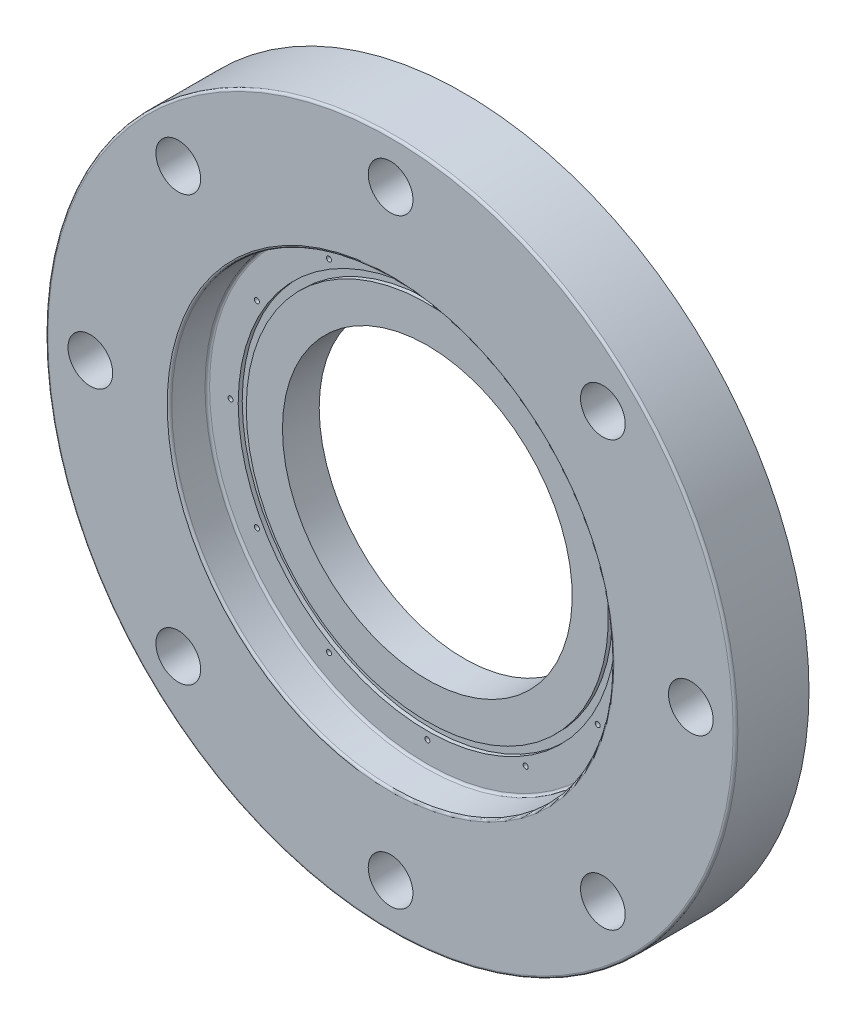
ISO-10303-21;
HEADER;
FILE_DESCRIPTION(('STEP AP214'),'2;1');
FILE_NAME('part.step','',(''),(''),'','','');
FILE_SCHEMA(('AUTOMOTIVE_DESIGN { 1 0 10303 214 1 1 1 1 }'));
ENDSEC;
DATA;
#1=APPLICATION_CONTEXT('core data for automotive mechanical design processes');
#2=APPLICATION_PROTOCOL_DEFINITION('international standard','automotive_design',2000,#1);
#3=PRODUCT_CONTEXT('',#1,'mechanical');
#4=PRODUCT('Part','Part','',(#3));
#5=PRODUCT_RELATED_PRODUCT_CATEGORY('part','',(#4));
#6=PRODUCT_DEFINITION_FORMATION('','',#4);
#7=PRODUCT_DEFINITION_CONTEXT('part definition',#1,'design');
#8=PRODUCT_DEFINITION('design','',#6,#7);
#9=PRODUCT_DEFINITION_SHAPE('','',#8);
#10=(LENGTH_UNIT() NAMED_UNIT(*) SI_UNIT(.MILLI.,.METRE.));
#11=(NAMED_UNIT(*) PLANE_ANGLE_UNIT() SI_UNIT($,.RADIAN.));
#12=(NAMED_UNIT(*) SI_UNIT($,.STERADIAN.) SOLID_ANGLE_UNIT());
#13=UNCERTAINTY_MEASURE_WITH_UNIT(LENGTH_MEASURE(1.E-05),#10,'distance_accuracy_value','');
#14=(GEOMETRIC_REPRESENTATION_CONTEXT(3) GLOBAL_UNCERTAINTY_ASSIGNED_CONTEXT((#13)) GLOBAL_UNIT_ASSIGNED_CONTEXT((#10,
#11,#12)) REPRESENTATION_CONTEXT('',''));
#15=CARTESIAN_POINT('',(0.,0.,0.));
#16=DIRECTION('',(0.,0.,1.));
#17=DIRECTION('',(1.,0.,0.));
#18=AXIS2_PLACEMENT_3D('',#15,#16,#17);
#19=CARTESIAN_POINT('',(0.,109.347,18.25625));
#20=DIRECTION('',(0.,0.,-1.));
#21=DIRECTION('',(0.,1.,0.));
#22=AXIS2_PLACEMENT_3D('',#19,#20,#21);
#23=PLANE('',#22);
#24=CARTESIAN_POINT('',(0.,0.,18.25625));
#25=DIRECTION('',(0.,0.,-1.));
#26=DIRECTION('',(0.,1.,0.));
#27=AXIS2_PLACEMENT_3D('',#24,#25,#26);
#28=CIRCLE('',#27,72.);
#29=CARTESIAN_POINT('',(0.,72.,18.25625));
#30=VERTEX_POINT('',#29);
#31=EDGE_CURVE('E42',#30,#30,#28,.T.);
#32=ORIENTED_EDGE('',*,*,#31,.T.);
#33=EDGE_LOOP('',(#32));
#34=FACE_BOUND('',#33,.T.);
#35=CARTESIAN_POINT('',(0.,0.,18.25625));
#36=DIRECTION('',(0.,0.,-1.));
#37=DIRECTION('',(-1.,0.,0.));
#38=AXIS2_PLACEMENT_3D('',#35,#36,#37);
#39=CIRCLE('',#38,90.);
#40=CARTESIAN_POINT('',(-90.,0.,18.25625));
#41=VERTEX_POINT('',#40);
#42=EDGE_CURVE('E834',#41,#41,#39,.T.);
#43=ORIENTED_EDGE('',*,*,#42,.F.);
#44=EDGE_LOOP('',(#43));
#45=FACE_BOUND('',#44,.T.);
#46=ADVANCED_FACE('F38',(#34,#45),#23,.F.);
#47=CARTESIAN_POINT('',(0.,0.,36.5125));
#48=DIRECTION('',(0.,0.,-1.));
#49=DIRECTION('',(-1.,0.,0.));
#50=AXIS2_PLACEMENT_3D('',#47,#48,#49);
#51=CYLINDRICAL_SURFACE('',#50,171.45);
#52=CARTESIAN_POINT('',(0.,0.,35.3579545454545));
#53=DIRECTION('',(0.,0.,1.));
#54=DIRECTION('',(1.,0.,0.));
#55=AXIS2_PLACEMENT_3D('',#52,#53,#54);
#56=CIRCLE('',#55,171.45);
#57=CARTESIAN_POINT('',(171.45,0.,35.3579545454545));
#58=VERTEX_POINT('',#57);
#59=EDGE_CURVE('E11',#58,#58,#56,.F.);
#60=ORIENTED_EDGE('',*,*,#59,.T.);
#61=EDGE_LOOP('',(#60));
#62=FACE_BOUND('',#61,.T.);
#63=CARTESIAN_POINT('',(0.,0.,0.));
#64=DIRECTION('',(0.,0.,1.));
#65=DIRECTION('',(1.,0.,0.));
#66=AXIS2_PLACEMENT_3D('',#63,#64,#65);
#67=CIRCLE('',#66,171.45);
#68=CARTESIAN_POINT('',(171.45,0.,0.));
#69=VERTEX_POINT('',#68);
#70=EDGE_CURVE('E216',#69,#69,#67,.T.);
#71=ORIENTED_EDGE('',*,*,#70,.T.);
#72=EDGE_LOOP('',(#71));
#73=FACE_BOUND('',#72,.T.);
#74=ADVANCED_FACE('F254',(#62,#73),#51,.T.);
#75=CARTESIAN_POINT('',(0.,0.,36.5125));
#76=DIRECTION('',(0.,0.,1.));
#77=DIRECTION('',(1.,0.,0.));
#78=AXIS2_PLACEMENT_3D('',#75,#76,#77);
#79=PLANE('',#78);
#80=CARTESIAN_POINT('',(0.,0.,36.5125));
#81=DIRECTION('',(0.,0.,1.));
#82=DIRECTION('',(1.,0.,0.));
#83=AXIS2_PLACEMENT_3D('',#80,#81,#82);
#84=CIRCLE('',#83,111.037468728978);
#85=CARTESIAN_POINT('',(111.037468728978,0.,36.5125));
#86=VERTEX_POINT('',#85);
#87=EDGE_CURVE('E47',#86,#86,#84,.F.);
#88=ORIENTED_EDGE('',*,*,#87,.T.);
#89=EDGE_LOOP('',(#88));
#90=FACE_BOUND('',#89,.T.);
#91=CARTESIAN_POINT('',(0.,0.,36.5125));
#92=DIRECTION('',(0.,0.,1.));
#93=DIRECTION('',(1.,0.,0.));
#94=AXIS2_PLACEMENT_3D('',#91,#92,#93);
#95=CIRCLE('',#94,170.295454545455);
#96=CARTESIAN_POINT('',(170.295454545455,0.,36.5125));
#97=VERTEX_POINT('',#96);
#98=EDGE_CURVE('E230',#97,#97,#95,.T.);
#99=ORIENTED_EDGE('',*,*,#98,.T.);
#100=EDGE_LOOP('',(#99));
#101=FACE_BOUND('',#100,.T.);
#102=CARTESIAN_POINT('',(105.518009422561,105.518009422564,36.5125));
#103=DIRECTION('',(0.,0.,1.));
#104=DIRECTION('',(0.707106781186556,-0.707106781186539,0.));
#105=AXIS2_PLACEMENT_3D('',#102,#103,#104);
#106=CIRCLE('',#105,11.1125);
#107=CARTESIAN_POINT('',(113.375733528497,97.6602853166284,36.5125));
#108=VERTEX_POINT('',#107);
#109=EDGE_CURVE('E174',#108,#108,#106,.T.);
#110=ORIENTED_EDGE('',*,*,#109,.F.);
#111=EDGE_LOOP('',(#110));
#112=FACE_BOUND('',#111,.T.);
#113=CARTESIAN_POINT('',(149.225,1.5630489083666E-12,36.5125));
#114=DIRECTION('',(0.,0.,1.));
#115=DIRECTION('',(0.,-1.,0.));
#116=AXIS2_PLACEMENT_3D('',#113,#114,#115);
#117=CIRCLE('',#116,11.1125);
#118=CARTESIAN_POINT('',(149.225,-11.1124999999984,36.5125));
#119=VERTEX_POINT('',#118);
#120=EDGE_CURVE('E173',#119,#119,#117,.T.);
#121=ORIENTED_EDGE('',*,*,#120,.F.);
#122=EDGE_LOOP('',(#121));
#123=FACE_BOUND('',#122,.T.);
#124=CARTESIAN_POINT('',(105.518009422563,-105.518009422562,36.5125));
#125=DIRECTION('',(0.,0.,1.));
#126=DIRECTION('',(-0.707106781186541,-0.707106781186554,0.));
#127=AXIS2_PLACEMENT_3D('',#124,#125,#126);
#128=CIRCLE('',#127,11.1125);
#129=CARTESIAN_POINT('',(97.660285316628,-113.375733528497,36.5125));
#130=VERTEX_POINT('',#129);
#131=EDGE_CURVE('E180',#130,#130,#128,.T.);
#132=ORIENTED_EDGE('',*,*,#131,.F.);
#133=EDGE_LOOP('',(#132));
#134=FACE_BOUND('',#133,.T.);
#135=CARTESIAN_POINT('',(1.04203260557773E-12,-149.225,36.5125));
#136=DIRECTION('',(0.,0.,1.));
#137=DIRECTION('',(-1.,0.,0.));
#138=AXIS2_PLACEMENT_3D('',#135,#136,#137);
#139=CIRCLE('',#138,11.1125);
#140=CARTESIAN_POINT('',(-11.112499999999,-149.225,36.5125));
#141=VERTEX_POINT('',#140);
#142=EDGE_CURVE('E186',#141,#141,#139,.T.);
#143=ORIENTED_EDGE('',*,*,#142,.F.);
#144=EDGE_LOOP('',(#143));
#145=FACE_BOUND('',#144,.T.);
#146=CARTESIAN_POINT('',(-105.518009422562,-105.518009422563,36.5125));
#147=DIRECTION('',(0.,0.,1.));
#148=DIRECTION('',(-0.707106781186551,0.707106781186544,0.));
#149=AXIS2_PLACEMENT_3D('',#146,#147,#148);
#150=CIRCLE('',#149,11.1125);
#151=CARTESIAN_POINT('',(-113.375733528498,-97.6602853166276,36.5125));
#152=VERTEX_POINT('',#151);
#153=EDGE_CURVE('E192',#152,#152,#150,.T.);
#154=ORIENTED_EDGE('',*,*,#153,.F.);
#155=EDGE_LOOP('',(#154));
#156=FACE_BOUND('',#155,.T.);
#157=CARTESIAN_POINT('',(-149.225,-5.21016302788867E-13,36.5125));
#158=DIRECTION('',(0.,0.,1.));
#159=DIRECTION('',(0.,1.,0.));
#160=AXIS2_PLACEMENT_3D('',#157,#158,#159);
#161=CIRCLE('',#160,11.1125);
#162=CARTESIAN_POINT('',(-149.225,11.1124999999995,36.5125));
#163=VERTEX_POINT('',#162);
#164=EDGE_CURVE('E198',#163,#163,#161,.T.);
#165=ORIENTED_EDGE('',*,*,#164,.F.);
#166=EDGE_LOOP('',(#165));
#167=FACE_BOUND('',#166,.T.);
#168=CARTESIAN_POINT('',(-105.518009422563,105.518009422562,36.5125));
#169=DIRECTION('',(0.,0.,1.));
#170=DIRECTION('',(0.707106781186546,0.707106781186549,0.));
#171=AXIS2_PLACEMENT_3D('',#168,#169,#170);
#172=CIRCLE('',#171,11.1125);
#173=CARTESIAN_POINT('',(-97.6602853166273,113.375733528498,36.5125));
#174=VERTEX_POINT('',#173);
#175=EDGE_CURVE('E204',#174,#174,#172,.T.);
#176=ORIENTED_EDGE('',*,*,#175,.F.);
#177=EDGE_LOOP('',(#176));
#178=FACE_BOUND('',#177,.T.);
#179=CARTESIAN_POINT('',(0.,149.225,36.5125));
#180=DIRECTION('',(0.,0.,1.));
#181=DIRECTION('',(1.,0.,0.));
#182=AXIS2_PLACEMENT_3D('',#179,#180,#181);
#183=CIRCLE('',#182,11.1125);
#184=CARTESIAN_POINT('',(11.1125,149.225,36.5125));
#185=VERTEX_POINT('',#184);
#186=EDGE_CURVE('E210',#185,#185,#183,.T.);
#187=ORIENTED_EDGE('',*,*,#186,.F.);
#188=EDGE_LOOP('',(#187));
#189=FACE_BOUND('',#188,.T.);
#190=ADVANCED_FACE('F236',(#90,#101,#112,#123,#134,#145,#156,#167,#178,#189),#79,.T.);
#191=CARTESIAN_POINT('',(0.,0.,0.));
#192=DIRECTION('',(0.,0.,1.));
#193=DIRECTION('',(1.,0.,0.));
#194=AXIS2_PLACEMENT_3D('',#191,#192,#193);
#195=PLANE('',#194);
#196=CARTESIAN_POINT('',(0.,0.,0.));
#197=DIRECTION('',(0.,0.,-1.));
#198=DIRECTION('',(-1.,0.,0.));
#199=AXIS2_PLACEMENT_3D('',#196,#197,#198);
#200=CIRCLE('',#199,72.);
#201=CARTESIAN_POINT('',(-72.,0.,0.));
#202=VERTEX_POINT('',#201);
#203=EDGE_CURVE('E167',#202,#202,#200,.T.);
#204=ORIENTED_EDGE('',*,*,#203,.F.);
#205=EDGE_LOOP('',(#204));
#206=FACE_BOUND('',#205,.T.);
#207=CARTESIAN_POINT('',(105.518009422561,105.518009422564,0.));
#208=DIRECTION('',(0.,0.,1.));
#209=DIRECTION('',(0.707106781186556,-0.707106781186539,0.));
#210=AXIS2_PLACEMENT_3D('',#207,#208,#209);
#211=CIRCLE('',#210,11.1125);
#212=CARTESIAN_POINT('',(113.375733528497,97.6602853166284,0.));
#213=VERTEX_POINT('',#212);
#214=EDGE_CURVE('E170',#213,#213,#211,.T.);
#215=ORIENTED_EDGE('',*,*,#214,.T.);
#216=EDGE_LOOP('',(#215));
#217=FACE_BOUND('',#216,.T.);
#218=CARTESIAN_POINT('',(149.225,1.5630489083666E-12,0.));
#219=DIRECTION('',(0.,0.,1.));
#220=DIRECTION('',(0.,-1.,0.));
#221=AXIS2_PLACEMENT_3D('',#218,#219,#220);
#222=CIRCLE('',#221,11.1125);
#223=CARTESIAN_POINT('',(149.225,-11.1124999999984,0.));
#224=VERTEX_POINT('',#223);
#225=EDGE_CURVE('E177',#224,#224,#222,.T.);
#226=ORIENTED_EDGE('',*,*,#225,.T.);
#227=EDGE_LOOP('',(#226));
#228=FACE_BOUND('',#227,.T.);
#229=CARTESIAN_POINT('',(105.518009422563,-105.518009422562,0.));
#230=DIRECTION('',(0.,0.,1.));
#231=DIRECTION('',(-0.707106781186541,-0.707106781186554,0.));
#232=AXIS2_PLACEMENT_3D('',#229,#230,#231);
#233=CIRCLE('',#232,11.1125);
#234=CARTESIAN_POINT('',(97.660285316628,-113.375733528497,0.));
#235=VERTEX_POINT('',#234);
#236=EDGE_CURVE('E183',#235,#235,#233,.T.);
#237=ORIENTED_EDGE('',*,*,#236,.T.);
#238=EDGE_LOOP('',(#237));
#239=FACE_BOUND('',#238,.T.);
#240=CARTESIAN_POINT('',(1.04203260557773E-12,-149.225,0.));
#241=DIRECTION('',(0.,0.,1.));
#242=DIRECTION('',(-1.,0.,0.));
#243=AXIS2_PLACEMENT_3D('',#240,#241,#242);
#244=CIRCLE('',#243,11.1125);
#245=CARTESIAN_POINT('',(-11.112499999999,-149.225,0.));
#246=VERTEX_POINT('',#245);
#247=EDGE_CURVE('E189',#246,#246,#244,.T.);
#248=ORIENTED_EDGE('',*,*,#247,.T.);
#249=EDGE_LOOP('',(#248));
#250=FACE_BOUND('',#249,.T.);
#251=CARTESIAN_POINT('',(-105.518009422562,-105.518009422563,0.));
#252=DIRECTION('',(0.,0.,1.));
#253=DIRECTION('',(-0.707106781186551,0.707106781186544,0.));
#254=AXIS2_PLACEMENT_3D('',#251,#252,#253);
#255=CIRCLE('',#254,11.1125);
#256=CARTESIAN_POINT('',(-113.375733528498,-97.6602853166276,0.));
#257=VERTEX_POINT('',#256);
#258=EDGE_CURVE('E195',#257,#257,#255,.T.);
#259=ORIENTED_EDGE('',*,*,#258,.T.);
#260=EDGE_LOOP('',(#259));
#261=FACE_BOUND('',#260,.T.);
#262=CARTESIAN_POINT('',(-149.225,-5.21016302788867E-13,0.));
#263=DIRECTION('',(0.,0.,1.));
#264=DIRECTION('',(0.,1.,0.));
#265=AXIS2_PLACEMENT_3D('',#262,#263,#264);
#266=CIRCLE('',#265,11.1125);
#267=CARTESIAN_POINT('',(-149.225,11.1124999999995,0.));
#268=VERTEX_POINT('',#267);
#269=EDGE_CURVE('E201',#268,#268,#266,.T.);
#270=ORIENTED_EDGE('',*,*,#269,.T.);
#271=EDGE_LOOP('',(#270));
#272=FACE_BOUND('',#271,.T.);
#273=CARTESIAN_POINT('',(-105.518009422563,105.518009422562,0.));
#274=DIRECTION('',(0.,0.,1.));
#275=DIRECTION('',(0.707106781186546,0.707106781186549,0.));
#276=AXIS2_PLACEMENT_3D('',#273,#274,#275);
#277=CIRCLE('',#276,11.1125);
#278=CARTESIAN_POINT('',(-97.6602853166273,113.375733528498,0.));
#279=VERTEX_POINT('',#278);
#280=EDGE_CURVE('E207',#279,#279,#277,.T.);
#281=ORIENTED_EDGE('',*,*,#280,.T.);
#282=EDGE_LOOP('',(#281));
#283=FACE_BOUND('',#282,.T.);
#284=CARTESIAN_POINT('',(0.,149.225,0.));
#285=DIRECTION('',(0.,0.,1.));
#286=DIRECTION('',(1.,0.,0.));
#287=AXIS2_PLACEMENT_3D('',#284,#285,#286);
#288=CIRCLE('',#287,11.1125);
#289=CARTESIAN_POINT('',(11.1125,149.225,0.));
#290=VERTEX_POINT('',#289);
#291=EDGE_CURVE('E213',#290,#290,#288,.T.);
#292=ORIENTED_EDGE('',*,*,#291,.T.);
#293=EDGE_LOOP('',(#292));
#294=FACE_BOUND('',#293,.T.);
#295=ORIENTED_EDGE('',*,*,#70,.F.);
#296=EDGE_LOOP('',(#295));
#297=FACE_BOUND('',#296,.T.);
#298=ADVANCED_FACE('F334',(#206,#217,#228,#239,#250,#261,#272,#283,#294,#297),#195,.F.);
#299=CARTESIAN_POINT('',(0.,149.225,0.));
#300=DIRECTION('',(0.,0.,1.));
#301=DIRECTION('',(1.,0.,0.));
#302=AXIS2_PLACEMENT_3D('',#299,#300,#301);
#303=CYLINDRICAL_SURFACE('',#302,11.1125);
#304=ORIENTED_EDGE('',*,*,#291,.F.);
#305=EDGE_LOOP('',(#304));
#306=FACE_BOUND('',#305,.T.);
#307=ORIENTED_EDGE('',*,*,#186,.T.);
#308=EDGE_LOOP('',(#307));
#309=FACE_BOUND('',#308,.T.);
#310=ADVANCED_FACE('F337',(#306,#309),#303,.F.);
#311=CARTESIAN_POINT('',(-105.518009422563,105.518009422562,0.));
#312=DIRECTION('',(0.,0.,1.));
#313=DIRECTION('',(1.,0.,0.));
#314=AXIS2_PLACEMENT_3D('',#311,#312,#313);
#315=CYLINDRICAL_SURFACE('',#314,11.1125);
#316=ORIENTED_EDGE('',*,*,#280,.F.);
#317=EDGE_LOOP('',(#316));
#318=FACE_BOUND('',#317,.T.);
#319=ORIENTED_EDGE('',*,*,#175,.T.);
#320=EDGE_LOOP('',(#319));
#321=FACE_BOUND('',#320,.T.);
#322=ADVANCED_FACE('F360',(#318,#321),#315,.F.);
#323=CARTESIAN_POINT('',(-149.225,-5.21016302788867E-13,0.));
#324=DIRECTION('',(0.,0.,1.));
#325=DIRECTION('',(1.,0.,0.));
#326=AXIS2_PLACEMENT_3D('',#323,#324,#325);
#327=CYLINDRICAL_SURFACE('',#326,11.1125);
#328=ORIENTED_EDGE('',*,*,#269,.F.);
#329=EDGE_LOOP('',(#328));
#330=FACE_BOUND('',#329,.T.);
#331=ORIENTED_EDGE('',*,*,#164,.T.);
#332=EDGE_LOOP('',(#331));
#333=FACE_BOUND('',#332,.T.);
#334=ADVANCED_FACE('F371',(#330,#333),#327,.F.);
#335=CARTESIAN_POINT('',(-105.518009422562,-105.518009422563,0.));
#336=DIRECTION('',(0.,0.,1.));
#337=DIRECTION('',(1.,0.,0.));
#338=AXIS2_PLACEMENT_3D('',#335,#336,#337);
#339=CYLINDRICAL_SURFACE('',#338,11.1125);
#340=ORIENTED_EDGE('',*,*,#258,.F.);
#341=EDGE_LOOP('',(#340));
#342=FACE_BOUND('',#341,.T.);
#343=ORIENTED_EDGE('',*,*,#153,.T.);
#344=EDGE_LOOP('',(#343));
#345=FACE_BOUND('',#344,.T.);
#346=ADVANCED_FACE('F375',(#342,#345),#339,.F.);
#347=CARTESIAN_POINT('',(1.04203260557773E-12,-149.225,0.));
#348=DIRECTION('',(0.,0.,1.));
#349=DIRECTION('',(1.,0.,0.));
#350=AXIS2_PLACEMENT_3D('',#347,#348,#349);
#351=CYLINDRICAL_SURFACE('',#350,11.1125);
#352=ORIENTED_EDGE('',*,*,#247,.F.);
#353=EDGE_LOOP('',(#352));
#354=FACE_BOUND('',#353,.T.);
#355=ORIENTED_EDGE('',*,*,#142,.T.);
#356=EDGE_LOOP('',(#355));
#357=FACE_BOUND('',#356,.T.);
#358=ADVANCED_FACE('F379',(#354,#357),#351,.F.);
#359=CARTESIAN_POINT('',(105.518009422563,-105.518009422562,0.));
#360=DIRECTION('',(0.,0.,1.));
#361=DIRECTION('',(1.,0.,0.));
#362=AXIS2_PLACEMENT_3D('',#359,#360,#361);
#363=CYLINDRICAL_SURFACE('',#362,11.1125);
#364=ORIENTED_EDGE('',*,*,#236,.F.);
#365=EDGE_LOOP('',(#364));
#366=FACE_BOUND('',#365,.T.);
#367=ORIENTED_EDGE('',*,*,#131,.T.);
#368=EDGE_LOOP('',(#367));
#369=FACE_BOUND('',#368,.T.);
#370=ADVANCED_FACE('F383',(#366,#369),#363,.F.);
#371=CARTESIAN_POINT('',(149.225,1.5630489083666E-12,0.));
#372=DIRECTION('',(0.,0.,1.));
#373=DIRECTION('',(1.,0.,0.));
#374=AXIS2_PLACEMENT_3D('',#371,#372,#373);
#375=CYLINDRICAL_SURFACE('',#374,11.1125);
#376=ORIENTED_EDGE('',*,*,#225,.F.);
#377=EDGE_LOOP('',(#376));
#378=FACE_BOUND('',#377,.T.);
#379=ORIENTED_EDGE('',*,*,#120,.T.);
#380=EDGE_LOOP('',(#379));
#381=FACE_BOUND('',#380,.T.);
#382=ADVANCED_FACE('F275',(#378,#381),#375,.F.);
#383=CARTESIAN_POINT('',(105.518009422561,105.518009422564,0.));
#384=DIRECTION('',(0.,0.,1.));
#385=DIRECTION('',(1.,0.,0.));
#386=AXIS2_PLACEMENT_3D('',#383,#384,#385);
#387=CYLINDRICAL_SURFACE('',#386,11.1125);
#388=ORIENTED_EDGE('',*,*,#214,.F.);
#389=EDGE_LOOP('',(#388));
#390=FACE_BOUND('',#389,.T.);
#391=ORIENTED_EDGE('',*,*,#109,.T.);
#392=EDGE_LOOP('',(#391));
#393=FACE_BOUND('',#392,.T.);
#394=ADVANCED_FACE('F268',(#390,#393),#387,.F.);
#395=CARTESIAN_POINT('',(0.,0.,18.25625));
#396=DIRECTION('',(0.,0.,-1.));
#397=DIRECTION('',(-1.,0.,0.));
#398=AXIS2_PLACEMENT_3D('',#395,#396,#397);
#399=CIRCLE('',#398,94.);
#400=CARTESIAN_POINT('',(-94.,0.,18.25625));
#401=VERTEX_POINT('',#400);
#402=EDGE_CURVE('E280',#401,#401,#399,.T.);
#403=ORIENTED_EDGE('',*,*,#402,.T.);
#404=EDGE_LOOP('',(#403));
#405=FACE_BOUND('',#404,.T.);
#406=CARTESIAN_POINT('',(-48.8950000000067,84.6886242360764,18.25625));
#407=DIRECTION('',(0.,0.,1.));
#408=DIRECTION('',(1.,0.,0.));
#409=AXIS2_PLACEMENT_3D('',#406,#407,#408);
#410=CIRCLE('',#409,1.24999999999999);
#411=CARTESIAN_POINT('',(-47.6450000000067,84.6886242360764,18.25625));
#412=VERTEX_POINT('',#411);
#413=EDGE_CURVE('E95',#412,#412,#410,.T.);
#414=ORIENTED_EDGE('',*,*,#413,.F.);
#415=EDGE_LOOP('',(#414));
#416=FACE_BOUND('',#415,.T.);
#417=CARTESIAN_POINT('',(-84.6886242360838,48.8949999999939,18.25625));
#418=DIRECTION('',(0.,0.,1.));
#419=DIRECTION('',(1.,0.,0.));
#420=AXIS2_PLACEMENT_3D('',#417,#418,#419);
#421=CIRCLE('',#420,1.24999999999999);
#422=CARTESIAN_POINT('',(-83.4386242360838,48.8949999999939,18.25625));
#423=VERTEX_POINT('',#422);
#424=EDGE_CURVE('E94',#423,#423,#421,.T.);
#425=ORIENTED_EDGE('',*,*,#424,.F.);
#426=EDGE_LOOP('',(#425));
#427=FACE_BOUND('',#426,.T.);
#428=CARTESIAN_POINT('',(-97.79,-6.27152140327151E-12,18.25625));
#429=DIRECTION('',(0.,0.,1.));
#430=DIRECTION('',(1.,0.,0.));
#431=AXIS2_PLACEMENT_3D('',#428,#429,#430);
#432=CIRCLE('',#431,1.24999999999999);
#433=CARTESIAN_POINT('',(-96.54,-6.27152140327151E-12,18.25625));
#434=VERTEX_POINT('',#433);
#435=EDGE_CURVE('E107',#434,#434,#432,.T.);
#436=ORIENTED_EDGE('',*,*,#435,.F.);
#437=EDGE_LOOP('',(#436));
#438=FACE_BOUND('',#437,.T.);
#439=CARTESIAN_POINT('',(-84.6886242360775,-48.8950000000049,18.25625));
#440=DIRECTION('',(0.,0.,1.));
#441=DIRECTION('',(1.,0.,0.));
#442=AXIS2_PLACEMENT_3D('',#439,#440,#441);
#443=CIRCLE('',#442,1.24999999999999);
#444=CARTESIAN_POINT('',(-83.4386242360775,-48.8950000000049,18.25625));
#445=VERTEX_POINT('',#444);
#446=EDGE_CURVE('E113',#445,#445,#443,.T.);
#447=ORIENTED_EDGE('',*,*,#446,.F.);
#448=EDGE_LOOP('',(#447));
#449=FACE_BOUND('',#448,.T.);
#450=CARTESIAN_POINT('',(-48.8949999999958,-84.6886242360827,18.25625));
#451=DIRECTION('',(0.,0.,1.));
#452=DIRECTION('',(1.,0.,0.));
#453=AXIS2_PLACEMENT_3D('',#450,#451,#452);
#454=CIRCLE('',#453,1.24999999999999);
#455=CARTESIAN_POINT('',(-47.6449999999958,-84.6886242360827,18.25625));
#456=VERTEX_POINT('',#455);
#457=EDGE_CURVE('E119',#456,#456,#454,.T.);
#458=ORIENTED_EDGE('',*,*,#457,.F.);
#459=EDGE_LOOP('',(#458));
#460=FACE_BOUND('',#459,.T.);
#461=CARTESIAN_POINT('',(4.18101426884767E-12,-97.79,18.25625));
#462=DIRECTION('',(0.,0.,1.));
#463=DIRECTION('',(1.,0.,0.));
#464=AXIS2_PLACEMENT_3D('',#461,#462,#463);
#465=CIRCLE('',#464,1.24999999999999);
#466=CARTESIAN_POINT('',(1.25000000000417,-97.79,18.25625));
#467=VERTEX_POINT('',#466);
#468=EDGE_CURVE('E125',#467,#467,#465,.T.);
#469=ORIENTED_EDGE('',*,*,#468,.F.);
#470=EDGE_LOOP('',(#469));
#471=FACE_BOUND('',#470,.T.);
#472=CARTESIAN_POINT('',(48.895000000003,-84.6886242360785,18.25625));
#473=DIRECTION('',(0.,0.,1.));
#474=DIRECTION('',(1.,0.,0.));
#475=AXIS2_PLACEMENT_3D('',#472,#473,#474);
#476=CIRCLE('',#475,1.24999999999999);
#477=CARTESIAN_POINT('',(50.145000000003,-84.6886242360785,18.25625));
#478=VERTEX_POINT('',#477);
#479=EDGE_CURVE('E131',#478,#478,#476,.T.);
#480=ORIENTED_EDGE('',*,*,#479,.F.);
#481=EDGE_LOOP('',(#480));
#482=FACE_BOUND('',#481,.T.);
#483=CARTESIAN_POINT('',(84.6886242360817,-48.8949999999976,18.25625));
#484=DIRECTION('',(0.,0.,1.));
#485=DIRECTION('',(1.,0.,0.));
#486=AXIS2_PLACEMENT_3D('',#483,#484,#485);
#487=CIRCLE('',#486,1.24999999999999);
#488=CARTESIAN_POINT('',(85.9386242360817,-48.8949999999976,18.25625));
#489=VERTEX_POINT('',#488);
#490=EDGE_CURVE('E137',#489,#489,#487,.T.);
#491=ORIENTED_EDGE('',*,*,#490,.F.);
#492=EDGE_LOOP('',(#491));
#493=FACE_BOUND('',#492,.T.);
#494=CARTESIAN_POINT('',(97.79,2.09050713442384E-12,18.25625));
#495=DIRECTION('',(0.,0.,1.));
#496=DIRECTION('',(1.,0.,0.));
#497=AXIS2_PLACEMENT_3D('',#494,#495,#496);
#498=CIRCLE('',#497,1.24999999999999);
#499=CARTESIAN_POINT('',(99.04,2.09050713442384E-12,18.25625));
#500=VERTEX_POINT('',#499);
#501=EDGE_CURVE('E143',#500,#500,#498,.T.);
#502=ORIENTED_EDGE('',*,*,#501,.F.);
#503=EDGE_LOOP('',(#502));
#504=FACE_BOUND('',#503,.T.);
#505=CARTESIAN_POINT('',(84.6886242360796,48.8950000000012,18.25625));
#506=DIRECTION('',(0.,0.,1.));
#507=DIRECTION('',(1.,0.,0.));
#508=AXIS2_PLACEMENT_3D('',#505,#506,#507);
#509=CIRCLE('',#508,1.24999999999999);
#510=CARTESIAN_POINT('',(85.9386242360795,48.8950000000012,18.25625));
#511=VERTEX_POINT('',#510);
#512=EDGE_CURVE('E149',#511,#511,#509,.T.);
#513=ORIENTED_EDGE('',*,*,#512,.F.);
#514=EDGE_LOOP('',(#513));
#515=FACE_BOUND('',#514,.T.);
#516=CARTESIAN_POINT('',(48.8949999999994,84.6886242360806,18.25625));
#517=DIRECTION('',(0.,0.,1.));
#518=DIRECTION('',(1.,0.,0.));
#519=AXIS2_PLACEMENT_3D('',#516,#517,#518);
#520=CIRCLE('',#519,1.24999999999999);
#521=CARTESIAN_POINT('',(50.1449999999994,84.6886242360806,18.25625));
#522=VERTEX_POINT('',#521);
#523=EDGE_CURVE('E155',#522,#522,#520,.T.);
#524=ORIENTED_EDGE('',*,*,#523,.F.);
#525=EDGE_LOOP('',(#524));
#526=FACE_BOUND('',#525,.T.);
#527=CARTESIAN_POINT('',(0.,97.79,18.25625));
#528=DIRECTION('',(0.,0.,1.));
#529=DIRECTION('',(1.,0.,0.));
#530=AXIS2_PLACEMENT_3D('',#527,#528,#529);
#531=CIRCLE('',#530,1.24999999999999);
#532=CARTESIAN_POINT('',(1.24999999999999,97.79,18.25625));
#533=VERTEX_POINT('',#532);
#534=EDGE_CURVE('E161',#533,#533,#531,.T.);
#535=ORIENTED_EDGE('',*,*,#534,.F.);
#536=EDGE_LOOP('',(#535));
#537=FACE_BOUND('',#536,.T.);
#538=CARTESIAN_POINT('',(0.,0.,18.25625));
#539=DIRECTION('',(0.,0.,-1.));
#540=DIRECTION('',(0.,1.,0.));
#541=AXIS2_PLACEMENT_3D('',#538,#539,#540);
#542=CIRCLE('',#541,108.228031271022);
#543=CARTESIAN_POINT('',(0.,108.228031271022,18.25625));
#544=VERTEX_POINT('',#543);
#545=EDGE_CURVE('E227',#544,#544,#542,.F.);
#546=ORIENTED_EDGE('',*,*,#545,.T.);
#547=EDGE_LOOP('',(#546));
#548=FACE_BOUND('',#547,.T.);
#549=ADVANCED_FACE('F257',(#405,#416,#427,#438,#449,#460,#471,#482,#493,#504,#515,#526,#537,
#548),#23,.F.);
#550=CARTESIAN_POINT('',(0.,0.,18.25625));
#551=DIRECTION('',(0.,0.,1.));
#552=DIRECTION('',(0.,-1.,0.));
#553=AXIS2_PLACEMENT_3D('',#550,#551,#552);
#554=CONICAL_SURFACE('',#553,109.347,0.0312941281419109);
#555=CARTESIAN_POINT('',(0.,0.,19.3746708580904));
#556=DIRECTION('',(0.,0.,1.));
#557=DIRECTION('',(0.,-1.,0.));
#558=AXIS2_PLACEMENT_3D('',#555,#556,#557);
#559=CIRCLE('',#558,109.382011435558);
#560=CARTESIAN_POINT('',(0.,-109.382011435558,19.3746708580904));
#561=VERTEX_POINT('',#560);
#562=EDGE_CURVE('E224',#561,#561,#559,.F.);
#563=ORIENTED_EDGE('',*,*,#562,.T.);
#564=EDGE_LOOP('',(#563));
#565=FACE_BOUND('',#564,.T.);
#566=CARTESIAN_POINT('',(0.,0.,35.3940791419096));
#567=DIRECTION('',(0.,0.,1.));
#568=DIRECTION('',(0.,-1.,0.));
#569=AXIS2_PLACEMENT_3D('',#566,#567,#568);
#570=CIRCLE('',#569,109.883488564442);
#571=CARTESIAN_POINT('',(0.,-109.883488564442,35.3940791419096));
#572=VERTEX_POINT('',#571);
#573=EDGE_CURVE('E221',#572,#572,#570,.T.);
#574=ORIENTED_EDGE('',*,*,#573,.T.);
#575=EDGE_LOOP('',(#574));
#576=FACE_BOUND('',#575,.T.);
#577=ADVANCED_FACE('F249',(#565,#576),#554,.F.);
#578=CARTESIAN_POINT('',(0.,0.,19.4107954545455));
#579=DIRECTION('',(0.,0.,-1.));
#580=DIRECTION('',(0.,1.,0.));
#581=AXIS2_PLACEMENT_3D('',#578,#579,#580);
#582=TOROIDAL_SURFACE('',#581,108.228031271022,1.15454545454545);
#583=ORIENTED_EDGE('',*,*,#545,.F.);
#584=EDGE_LOOP('',(#583));
#585=FACE_BOUND('',#584,.T.);
#586=ORIENTED_EDGE('',*,*,#562,.F.);
#587=EDGE_LOOP('',(#586));
#588=FACE_BOUND('',#587,.T.);
#589=ADVANCED_FACE('F241',(#585,#588),#582,.F.);
#590=CARTESIAN_POINT('',(0.,0.,35.3579545454545));
#591=DIRECTION('',(0.,0.,1.));
#592=DIRECTION('',(1.,0.,0.));
#593=AXIS2_PLACEMENT_3D('',#590,#591,#592);
#594=TOROIDAL_SURFACE('',#593,111.037468728978,1.15454545454545);
#595=ORIENTED_EDGE('',*,*,#573,.F.);
#596=EDGE_LOOP('',(#595));
#597=FACE_BOUND('',#596,.T.);
#598=ORIENTED_EDGE('',*,*,#87,.F.);
#599=EDGE_LOOP('',(#598));
#600=FACE_BOUND('',#599,.T.);
#601=ADVANCED_FACE('F239',(#597,#600),#594,.T.);
#602=CARTESIAN_POINT('',(0.,0.,35.3579545454545));
#603=DIRECTION('',(0.,0.,1.));
#604=DIRECTION('',(1.,0.,0.));
#605=AXIS2_PLACEMENT_3D('',#602,#603,#604);
#606=TOROIDAL_SURFACE('',#605,170.295454545455,1.15454545454545);
#607=ORIENTED_EDGE('',*,*,#59,.F.);
#608=EDGE_LOOP('',(#607));
#609=FACE_BOUND('',#608,.T.);
#610=ORIENTED_EDGE('',*,*,#98,.F.);
#611=EDGE_LOOP('',(#610));
#612=FACE_BOUND('',#611,.T.);
#613=ADVANCED_FACE('F40',(#609,#612),#606,.T.);
#614=CARTESIAN_POINT('',(0.,0.,120.));
#615=DIRECTION('',(0.,0.,-1.));
#616=DIRECTION('',(-1.,0.,0.));
#617=AXIS2_PLACEMENT_3D('',#614,#615,#616);
#618=CYLINDRICAL_SURFACE('',#617,72.);
#619=ORIENTED_EDGE('',*,*,#203,.T.);
#620=EDGE_LOOP('',(#619));
#621=FACE_BOUND('',#620,.T.);
#622=ORIENTED_EDGE('',*,*,#31,.F.);
#623=EDGE_LOOP('',(#622));
#624=FACE_BOUND('',#623,.T.);
#625=ADVANCED_FACE('F247',(#621,#624),#618,.F.);
#626=CARTESIAN_POINT('',(0.,97.79,6.25625));
#627=DIRECTION('',(0.,0.,1.));
#628=DIRECTION('',(1.,0.,0.));
#629=AXIS2_PLACEMENT_3D('',#626,#627,#628);
#630=CONICAL_SURFACE('',#629,1.25,1.02974425867665);
#631=CARTESIAN_POINT('',(0.,97.79,5.50517422621555));
#632=VERTEX_POINT('',#631);
#633=VERTEX_LOOP('',#632);
#634=FACE_BOUND('',#633,.T.);
#635=CARTESIAN_POINT('',(0.,97.79,6.25625));
#636=DIRECTION('',(0.,0.,1.));
#637=DIRECTION('',(1.,0.,0.));
#638=AXIS2_PLACEMENT_3D('',#635,#636,#637);
#639=CIRCLE('',#638,1.25);
#640=CARTESIAN_POINT('',(1.25,97.79,6.25625));
#641=VERTEX_POINT('',#640);
#642=EDGE_CURVE('E164',#641,#641,#639,.T.);
#643=ORIENTED_EDGE('',*,*,#642,.T.);
#644=EDGE_LOOP('',(#643));
#645=FACE_BOUND('',#644,.T.);
#646=ADVANCED_FACE('F313',(#634,#645),#630,.F.);
#647=CARTESIAN_POINT('',(0.,97.79,18.25625));
#648=DIRECTION('',(0.,0.,1.));
#649=DIRECTION('',(1.,0.,0.));
#650=AXIS2_PLACEMENT_3D('',#647,#648,#649);
#651=CYLINDRICAL_SURFACE('',#650,1.24999999999999);
#652=ORIENTED_EDGE('',*,*,#642,.F.);
#653=EDGE_LOOP('',(#652));
#654=FACE_BOUND('',#653,.T.);
#655=ORIENTED_EDGE('',*,*,#534,.T.);
#656=EDGE_LOOP('',(#655));
#657=FACE_BOUND('',#656,.T.);
#658=ADVANCED_FACE('F310',(#654,#657),#651,.F.);
#659=CARTESIAN_POINT('',(48.8949999999994,84.6886242360806,6.25625));
#660=DIRECTION('',(0.,0.,1.));
#661=DIRECTION('',(1.,0.,0.));
#662=AXIS2_PLACEMENT_3D('',#659,#660,#661);
#663=CONICAL_SURFACE('',#662,1.24999999999999,1.02974425867665);
#664=CARTESIAN_POINT('',(48.8949999999994,84.6886242360806,5.50517422621555));
#665=VERTEX_POINT('',#664);
#666=VERTEX_LOOP('',#665);
#667=FACE_BOUND('',#666,.T.);
#668=CARTESIAN_POINT('',(48.8949999999994,84.6886242360806,6.25625));
#669=DIRECTION('',(0.,0.,1.));
#670=DIRECTION('',(1.,0.,0.));
#671=AXIS2_PLACEMENT_3D('',#668,#669,#670);
#672=CIRCLE('',#671,1.24999999999999);
#673=CARTESIAN_POINT('',(50.1449999999994,84.6886242360806,6.25625));
#674=VERTEX_POINT('',#673);
#675=EDGE_CURVE('E158',#674,#674,#672,.T.);
#676=ORIENTED_EDGE('',*,*,#675,.T.);
#677=EDGE_LOOP('',(#676));
#678=FACE_BOUND('',#677,.T.);
#679=ADVANCED_FACE('F312',(#667,#678),#663,.F.);
#680=CARTESIAN_POINT('',(48.8949999999994,84.6886242360806,18.25625));
#681=DIRECTION('',(0.,0.,1.));
#682=DIRECTION('',(1.,0.,0.));
#683=AXIS2_PLACEMENT_3D('',#680,#681,#682);
#684=CYLINDRICAL_SURFACE('',#683,1.24999999999999);
#685=ORIENTED_EDGE('',*,*,#675,.F.);
#686=EDGE_LOOP('',(#685));
#687=FACE_BOUND('',#686,.T.);
#688=ORIENTED_EDGE('',*,*,#523,.T.);
#689=EDGE_LOOP('',(#688));
#690=FACE_BOUND('',#689,.T.);
#691=ADVANCED_FACE('F320',(#687,#690),#684,.F.);
#692=CARTESIAN_POINT('',(84.6886242360796,48.8950000000012,6.25625));
#693=DIRECTION('',(0.,0.,1.));
#694=DIRECTION('',(1.,0.,0.));
#695=AXIS2_PLACEMENT_3D('',#692,#693,#694);
#696=CONICAL_SURFACE('',#695,1.25,1.02974425867665);
#697=CARTESIAN_POINT('',(84.6886242360796,48.8950000000012,5.50517422621555));
#698=VERTEX_POINT('',#697);
#699=VERTEX_LOOP('',#698);
#700=FACE_BOUND('',#699,.T.);
#701=CARTESIAN_POINT('',(84.6886242360796,48.8950000000012,6.25625));
#702=DIRECTION('',(0.,0.,1.));
#703=DIRECTION('',(1.,0.,0.));
#704=AXIS2_PLACEMENT_3D('',#701,#702,#703);
#705=CIRCLE('',#704,1.25);
#706=CARTESIAN_POINT('',(85.9386242360796,48.8950000000012,6.25625));
#707=VERTEX_POINT('',#706);
#708=EDGE_CURVE('E152',#707,#707,#705,.T.);
#709=ORIENTED_EDGE('',*,*,#708,.T.);
#710=EDGE_LOOP('',(#709));
#711=FACE_BOUND('',#710,.T.);
#712=ADVANCED_FACE('F551',(#700,#711),#696,.F.);
#713=CARTESIAN_POINT('',(84.6886242360796,48.8950000000012,18.25625));
#714=DIRECTION('',(0.,0.,1.));
#715=DIRECTION('',(1.,0.,0.));
#716=AXIS2_PLACEMENT_3D('',#713,#714,#715);
#717=CYLINDRICAL_SURFACE('',#716,1.24999999999999);
#718=ORIENTED_EDGE('',*,*,#708,.F.);
#719=EDGE_LOOP('',(#718));
#720=FACE_BOUND('',#719,.T.);
#721=ORIENTED_EDGE('',*,*,#512,.T.);
#722=EDGE_LOOP('',(#721));
#723=FACE_BOUND('',#722,.T.);
#724=ADVANCED_FACE('F546',(#720,#723),#717,.F.);
#725=CARTESIAN_POINT('',(97.79,2.09050713442384E-12,6.25625));
#726=DIRECTION('',(0.,0.,1.));
#727=DIRECTION('',(1.,0.,0.));
#728=AXIS2_PLACEMENT_3D('',#725,#726,#727);
#729=CONICAL_SURFACE('',#728,1.25,1.02974425867665);
#730=CARTESIAN_POINT('',(97.79,2.09050713442384E-12,5.50517422621555));
#731=VERTEX_POINT('',#730);
#732=VERTEX_LOOP('',#731);
#733=FACE_BOUND('',#732,.T.);
#734=CARTESIAN_POINT('',(97.79,2.09050713442384E-12,6.25625));
#735=DIRECTION('',(0.,0.,1.));
#736=DIRECTION('',(1.,0.,0.));
#737=AXIS2_PLACEMENT_3D('',#734,#735,#736);
#738=CIRCLE('',#737,1.25);
#739=CARTESIAN_POINT('',(99.04,2.09050713442384E-12,6.25625));
#740=VERTEX_POINT('',#739);
#741=EDGE_CURVE('E146',#740,#740,#738,.T.);
#742=ORIENTED_EDGE('',*,*,#741,.T.);
#743=EDGE_LOOP('',(#742));
#744=FACE_BOUND('',#743,.T.);
#745=ADVANCED_FACE('F539',(#733,#744),#729,.F.);
#746=CARTESIAN_POINT('',(97.79,2.09050713442384E-12,18.25625));
#747=DIRECTION('',(0.,0.,1.));
#748=DIRECTION('',(1.,0.,0.));
#749=AXIS2_PLACEMENT_3D('',#746,#747,#748);
#750=CYLINDRICAL_SURFACE('',#749,1.24999999999999);
#751=ORIENTED_EDGE('',*,*,#741,.F.);
#752=EDGE_LOOP('',(#751));
#753=FACE_BOUND('',#752,.T.);
#754=ORIENTED_EDGE('',*,*,#501,.T.);
#755=EDGE_LOOP('',(#754));
#756=FACE_BOUND('',#755,.T.);
#757=ADVANCED_FACE('F534',(#753,#756),#750,.F.);
#758=CARTESIAN_POINT('',(84.6886242360817,-48.8949999999976,6.25625));
#759=DIRECTION('',(0.,0.,1.));
#760=DIRECTION('',(1.,0.,0.));
#761=AXIS2_PLACEMENT_3D('',#758,#759,#760);
#762=CONICAL_SURFACE('',#761,1.25,1.02974425867665);
#763=CARTESIAN_POINT('',(84.6886242360817,-48.8949999999976,5.50517422621555));
#764=VERTEX_POINT('',#763);
#765=VERTEX_LOOP('',#764);
#766=FACE_BOUND('',#765,.T.);
#767=CARTESIAN_POINT('',(84.6886242360817,-48.8949999999976,6.25625));
#768=DIRECTION('',(0.,0.,1.));
#769=DIRECTION('',(1.,0.,0.));
#770=AXIS2_PLACEMENT_3D('',#767,#768,#769);
#771=CIRCLE('',#770,1.25);
#772=CARTESIAN_POINT('',(85.9386242360817,-48.8949999999976,6.25625));
#773=VERTEX_POINT('',#772);
#774=EDGE_CURVE('E140',#773,#773,#771,.T.);
#775=ORIENTED_EDGE('',*,*,#774,.T.);
#776=EDGE_LOOP('',(#775));
#777=FACE_BOUND('',#776,.T.);
#778=ADVANCED_FACE('F527',(#766,#777),#762,.F.);
#779=CARTESIAN_POINT('',(84.6886242360817,-48.8949999999976,18.25625));
#780=DIRECTION('',(0.,0.,1.));
#781=DIRECTION('',(1.,0.,0.));
#782=AXIS2_PLACEMENT_3D('',#779,#780,#781);
#783=CYLINDRICAL_SURFACE('',#782,1.24999999999999);
#784=ORIENTED_EDGE('',*,*,#774,.F.);
#785=EDGE_LOOP('',(#784));
#786=FACE_BOUND('',#785,.T.);
#787=ORIENTED_EDGE('',*,*,#490,.T.);
#788=EDGE_LOOP('',(#787));
#789=FACE_BOUND('',#788,.T.);
#790=ADVANCED_FACE('F522',(#786,#789),#783,.F.);
#791=CARTESIAN_POINT('',(48.895000000003,-84.6886242360785,6.25625));
#792=DIRECTION('',(0.,0.,1.));
#793=DIRECTION('',(1.,0.,0.));
#794=AXIS2_PLACEMENT_3D('',#791,#792,#793);
#795=CONICAL_SURFACE('',#794,1.24999999999999,1.02974425867665);
#796=CARTESIAN_POINT('',(48.895000000003,-84.6886242360785,5.50517422621555));
#797=VERTEX_POINT('',#796);
#798=VERTEX_LOOP('',#797);
#799=FACE_BOUND('',#798,.T.);
#800=CARTESIAN_POINT('',(48.895000000003,-84.6886242360785,6.25625));
#801=DIRECTION('',(0.,0.,1.));
#802=DIRECTION('',(1.,0.,0.));
#803=AXIS2_PLACEMENT_3D('',#800,#801,#802);
#804=CIRCLE('',#803,1.24999999999999);
#805=CARTESIAN_POINT('',(50.145000000003,-84.6886242360785,6.25625));
#806=VERTEX_POINT('',#805);
#807=EDGE_CURVE('E134',#806,#806,#804,.T.);
#808=ORIENTED_EDGE('',*,*,#807,.T.);
#809=EDGE_LOOP('',(#808));
#810=FACE_BOUND('',#809,.T.);
#811=ADVANCED_FACE('F515',(#799,#810),#795,.F.);
#812=CARTESIAN_POINT('',(48.895000000003,-84.6886242360785,18.25625));
#813=DIRECTION('',(0.,0.,1.));
#814=DIRECTION('',(1.,0.,0.));
#815=AXIS2_PLACEMENT_3D('',#812,#813,#814);
#816=CYLINDRICAL_SURFACE('',#815,1.24999999999999);
#817=ORIENTED_EDGE('',*,*,#807,.F.);
#818=EDGE_LOOP('',(#817));
#819=FACE_BOUND('',#818,.T.);
#820=ORIENTED_EDGE('',*,*,#479,.T.);
#821=EDGE_LOOP('',(#820));
#822=FACE_BOUND('',#821,.T.);
#823=ADVANCED_FACE('F510',(#819,#822),#816,.F.);
#824=CARTESIAN_POINT('',(4.18101426884767E-12,-97.79,6.25625));
#825=DIRECTION('',(0.,0.,1.));
#826=DIRECTION('',(1.,0.,0.));
#827=AXIS2_PLACEMENT_3D('',#824,#825,#826);
#828=CONICAL_SURFACE('',#827,1.25,1.02974425867665);
#829=CARTESIAN_POINT('',(4.17789115602126E-12,-97.79,5.50517422621555));
#830=VERTEX_POINT('',#829);
#831=VERTEX_LOOP('',#830);
#832=FACE_BOUND('',#831,.T.);
#833=CARTESIAN_POINT('',(4.18101426884767E-12,-97.79,6.25625));
#834=DIRECTION('',(0.,0.,1.));
#835=DIRECTION('',(1.,0.,0.));
#836=AXIS2_PLACEMENT_3D('',#833,#834,#835);
#837=CIRCLE('',#836,1.25);
#838=CARTESIAN_POINT('',(1.25000000000418,-97.79,6.25625));
#839=VERTEX_POINT('',#838);
#840=EDGE_CURVE('E128',#839,#839,#837,.T.);
#841=ORIENTED_EDGE('',*,*,#840,.T.);
#842=EDGE_LOOP('',(#841));
#843=FACE_BOUND('',#842,.T.);
#844=ADVANCED_FACE('F503',(#832,#843),#828,.F.);
#845=CARTESIAN_POINT('',(4.18101426884767E-12,-97.79,18.25625));
#846=DIRECTION('',(0.,0.,1.));
#847=DIRECTION('',(1.,0.,0.));
#848=AXIS2_PLACEMENT_3D('',#845,#846,#847);
#849=CYLINDRICAL_SURFACE('',#848,1.24999999999999);
#850=ORIENTED_EDGE('',*,*,#840,.F.);
#851=EDGE_LOOP('',(#850));
#852=FACE_BOUND('',#851,.T.);
#853=ORIENTED_EDGE('',*,*,#468,.T.);
#854=EDGE_LOOP('',(#853));
#855=FACE_BOUND('',#854,.T.);
#856=ADVANCED_FACE('F498',(#852,#855),#849,.F.);
#857=CARTESIAN_POINT('',(-48.8949999999958,-84.6886242360827,6.25625));
#858=DIRECTION('',(0.,0.,1.));
#859=DIRECTION('',(1.,0.,0.));
#860=AXIS2_PLACEMENT_3D('',#857,#858,#859);
#861=CONICAL_SURFACE('',#860,1.25,1.02974425867665);
#862=CARTESIAN_POINT('',(-48.8949999999958,-84.6886242360827,5.50517422621555));
#863=VERTEX_POINT('',#862);
#864=VERTEX_LOOP('',#863);
#865=FACE_BOUND('',#864,.T.);
#866=CARTESIAN_POINT('',(-48.8949999999958,-84.6886242360827,6.25625));
#867=DIRECTION('',(0.,0.,1.));
#868=DIRECTION('',(1.,0.,0.));
#869=AXIS2_PLACEMENT_3D('',#866,#867,#868);
#870=CIRCLE('',#869,1.25);
#871=CARTESIAN_POINT('',(-47.6449999999958,-84.6886242360827,6.25625));
#872=VERTEX_POINT('',#871);
#873=EDGE_CURVE('E122',#872,#872,#870,.T.);
#874=ORIENTED_EDGE('',*,*,#873,.T.);
#875=EDGE_LOOP('',(#874));
#876=FACE_BOUND('',#875,.T.);
#877=ADVANCED_FACE('F490',(#865,#876),#861,.F.);
#878=CARTESIAN_POINT('',(-48.8949999999958,-84.6886242360827,18.25625));
#879=DIRECTION('',(0.,0.,1.));
#880=DIRECTION('',(1.,0.,0.));
#881=AXIS2_PLACEMENT_3D('',#878,#879,#880);
#882=CYLINDRICAL_SURFACE('',#881,1.24999999999999);
#883=ORIENTED_EDGE('',*,*,#873,.F.);
#884=EDGE_LOOP('',(#883));
#885=FACE_BOUND('',#884,.T.);
#886=ORIENTED_EDGE('',*,*,#457,.T.);
#887=EDGE_LOOP('',(#886));
#888=FACE_BOUND('',#887,.T.);
#889=ADVANCED_FACE('F485',(#885,#888),#882,.F.);
#890=CARTESIAN_POINT('',(-84.6886242360775,-48.8950000000049,6.25625));
#891=DIRECTION('',(0.,0.,1.));
#892=DIRECTION('',(1.,0.,0.));
#893=AXIS2_PLACEMENT_3D('',#890,#891,#892);
#894=CONICAL_SURFACE('',#893,1.25,1.02974425867665);
#895=CARTESIAN_POINT('',(-84.6886242360775,-48.8950000000049,5.50517422621555));
#896=VERTEX_POINT('',#895);
#897=VERTEX_LOOP('',#896);
#898=FACE_BOUND('',#897,.T.);
#899=CARTESIAN_POINT('',(-84.6886242360775,-48.8950000000049,6.25625));
#900=DIRECTION('',(0.,0.,1.));
#901=DIRECTION('',(1.,0.,0.));
#902=AXIS2_PLACEMENT_3D('',#899,#900,#901);
#903=CIRCLE('',#902,1.25);
#904=CARTESIAN_POINT('',(-83.4386242360775,-48.8950000000049,6.25625));
#905=VERTEX_POINT('',#904);
#906=EDGE_CURVE('E116',#905,#905,#903,.T.);
#907=ORIENTED_EDGE('',*,*,#906,.T.);
#908=EDGE_LOOP('',(#907));
#909=FACE_BOUND('',#908,.T.);
#910=ADVANCED_FACE('F477',(#898,#909),#894,.F.);
#911=CARTESIAN_POINT('',(-84.6886242360775,-48.8950000000049,18.25625));
#912=DIRECTION('',(0.,0.,1.));
#913=DIRECTION('',(1.,0.,0.));
#914=AXIS2_PLACEMENT_3D('',#911,#912,#913);
#915=CYLINDRICAL_SURFACE('',#914,1.24999999999999);
#916=ORIENTED_EDGE('',*,*,#906,.F.);
#917=EDGE_LOOP('',(#916));
#918=FACE_BOUND('',#917,.T.);
#919=ORIENTED_EDGE('',*,*,#446,.T.);
#920=EDGE_LOOP('',(#919));
#921=FACE_BOUND('',#920,.T.);
#922=ADVANCED_FACE('F471',(#918,#921),#915,.F.);
#923=CARTESIAN_POINT('',(-97.79,-6.27152140327151E-12,6.25625));
#924=DIRECTION('',(0.,0.,1.));
#925=DIRECTION('',(1.,0.,0.));
#926=AXIS2_PLACEMENT_3D('',#923,#924,#925);
#927=CONICAL_SURFACE('',#926,1.25,1.02974425867665);
#928=CARTESIAN_POINT('',(-97.79,-6.27152140327151E-12,5.50517422621555));
#929=VERTEX_POINT('',#928);
#930=VERTEX_LOOP('',#929);
#931=FACE_BOUND('',#930,.T.);
#932=CARTESIAN_POINT('',(-97.79,-6.27152140327151E-12,6.25625));
#933=DIRECTION('',(0.,0.,1.));
#934=DIRECTION('',(1.,0.,0.));
#935=AXIS2_PLACEMENT_3D('',#932,#933,#934);
#936=CIRCLE('',#935,1.25);
#937=CARTESIAN_POINT('',(-96.54,-6.27152140327151E-12,6.25625));
#938=VERTEX_POINT('',#937);
#939=EDGE_CURVE('E110',#938,#938,#936,.T.);
#940=ORIENTED_EDGE('',*,*,#939,.T.);
#941=EDGE_LOOP('',(#940));
#942=FACE_BOUND('',#941,.T.);
#943=ADVANCED_FACE('F462',(#931,#942),#927,.F.);
#944=CARTESIAN_POINT('',(-97.79,-6.27152140327151E-12,18.25625));
#945=DIRECTION('',(0.,0.,1.));
#946=DIRECTION('',(1.,0.,0.));
#947=AXIS2_PLACEMENT_3D('',#944,#945,#946);
#948=CYLINDRICAL_SURFACE('',#947,1.24999999999999);
#949=ORIENTED_EDGE('',*,*,#939,.F.);
#950=EDGE_LOOP('',(#949));
#951=FACE_BOUND('',#950,.T.);
#952=ORIENTED_EDGE('',*,*,#435,.T.);
#953=EDGE_LOOP('',(#952));
#954=FACE_BOUND('',#953,.T.);
#955=ADVANCED_FACE('F456',(#951,#954),#948,.F.);
#956=CARTESIAN_POINT('',(-84.6886242360838,48.8949999999939,6.25625));
#957=DIRECTION('',(0.,0.,1.));
#958=DIRECTION('',(1.,0.,0.));
#959=AXIS2_PLACEMENT_3D('',#956,#957,#958);
#960=CONICAL_SURFACE('',#959,1.25,1.02974425867665);
#961=CARTESIAN_POINT('',(-84.6886242360838,48.8949999999939,5.50517422621555));
#962=VERTEX_POINT('',#961);
#963=VERTEX_LOOP('',#962);
#964=FACE_BOUND('',#963,.T.);
#965=CARTESIAN_POINT('',(-84.6886242360838,48.8949999999939,6.25625));
#966=DIRECTION('',(0.,0.,1.));
#967=DIRECTION('',(1.,0.,0.));
#968=AXIS2_PLACEMENT_3D('',#965,#966,#967);
#969=CIRCLE('',#968,1.25);
#970=CARTESIAN_POINT('',(-83.4386242360838,48.8949999999939,6.25625));
#971=VERTEX_POINT('',#970);
#972=EDGE_CURVE('E98',#971,#971,#969,.T.);
#973=ORIENTED_EDGE('',*,*,#972,.T.);
#974=EDGE_LOOP('',(#973));
#975=FACE_BOUND('',#974,.T.);
#976=ADVANCED_FACE('F448',(#964,#975),#960,.F.);
#977=CARTESIAN_POINT('',(-84.6886242360838,48.8949999999939,18.25625));
#978=DIRECTION('',(0.,0.,1.));
#979=DIRECTION('',(1.,0.,0.));
#980=AXIS2_PLACEMENT_3D('',#977,#978,#979);
#981=CYLINDRICAL_SURFACE('',#980,1.24999999999999);
#982=ORIENTED_EDGE('',*,*,#972,.F.);
#983=EDGE_LOOP('',(#982));
#984=FACE_BOUND('',#983,.T.);
#985=ORIENTED_EDGE('',*,*,#424,.T.);
#986=EDGE_LOOP('',(#985));
#987=FACE_BOUND('',#986,.T.);
#988=ADVANCED_FACE('F88',(#984,#987),#981,.F.);
#989=CARTESIAN_POINT('',(-48.8950000000067,84.6886242360764,6.25625));
#990=DIRECTION('',(0.,0.,1.));
#991=DIRECTION('',(1.,0.,0.));
#992=AXIS2_PLACEMENT_3D('',#989,#990,#991);
#993=CONICAL_SURFACE('',#992,1.25,1.02974425867665);
#994=CARTESIAN_POINT('',(-48.8950000000067,84.6886242360764,5.50517422621555));
#995=VERTEX_POINT('',#994);
#996=VERTEX_LOOP('',#995);
#997=FACE_BOUND('',#996,.T.);
#998=CARTESIAN_POINT('',(-48.8950000000067,84.6886242360764,6.25625));
#999=DIRECTION('',(0.,0.,1.));
#1000=DIRECTION('',(1.,0.,0.));
#1001=AXIS2_PLACEMENT_3D('',#998,#999,#1000);
#1002=CIRCLE('',#1001,1.25);
#1003=CARTESIAN_POINT('',(-47.6450000000067,84.6886242360764,6.25625));
#1004=VERTEX_POINT('',#1003);
#1005=EDGE_CURVE('E92',#1004,#1004,#1002,.T.);
#1006=ORIENTED_EDGE('',*,*,#1005,.T.);
#1007=EDGE_LOOP('',(#1006));
#1008=FACE_BOUND('',#1007,.T.);
#1009=ADVANCED_FACE('F84',(#997,#1008),#993,.F.);
#1010=CARTESIAN_POINT('',(-48.8950000000067,84.6886242360764,18.25625));
#1011=DIRECTION('',(0.,0.,1.));
#1012=DIRECTION('',(1.,0.,0.));
#1013=AXIS2_PLACEMENT_3D('',#1010,#1011,#1012);
#1014=CYLINDRICAL_SURFACE('',#1013,1.24999999999999);
#1015=ORIENTED_EDGE('',*,*,#1005,.F.);
#1016=EDGE_LOOP('',(#1015));
#1017=FACE_BOUND('',#1016,.T.);
#1018=ORIENTED_EDGE('',*,*,#413,.T.);
#1019=EDGE_LOOP('',(#1018));
#1020=FACE_BOUND('',#1019,.T.);
#1021=ADVANCED_FACE('F87',(#1017,#1020),#1014,.F.);
#1022=CARTESIAN_POINT('',(0.,0.,16.25625));
#1023=DIRECTION('',(0.,0.,-1.));
#1024=DIRECTION('',(-1.,0.,0.));
#1025=AXIS2_PLACEMENT_3D('',#1022,#1023,#1024);
#1026=PLANE('',#1025);
#1027=CARTESIAN_POINT('',(0.,0.,16.25625));
#1028=DIRECTION('',(0.,0.,-1.));
#1029=DIRECTION('',(-1.,0.,0.));
#1030=AXIS2_PLACEMENT_3D('',#1027,#1028,#1029);
#1031=CIRCLE('',#1030,94.);
#1032=CARTESIAN_POINT('',(-94.,0.,16.25625));
#1033=VERTEX_POINT('',#1032);
#1034=EDGE_CURVE('E101',#1033,#1033,#1031,.T.);
#1035=ORIENTED_EDGE('',*,*,#1034,.F.);
#1036=EDGE_LOOP('',(#1035));
#1037=FACE_BOUND('',#1036,.T.);
#1038=CARTESIAN_POINT('',(0.,0.,16.25625));
#1039=DIRECTION('',(0.,0.,-1.));
#1040=DIRECTION('',(-1.,0.,0.));
#1041=AXIS2_PLACEMENT_3D('',#1038,#1039,#1040);
#1042=CIRCLE('',#1041,90.);
#1043=CARTESIAN_POINT('',(-90.,0.,16.25625));
#1044=VERTEX_POINT('',#1043);
#1045=EDGE_CURVE('E831',#1044,#1044,#1042,.T.);
#1046=ORIENTED_EDGE('',*,*,#1045,.T.);
#1047=EDGE_LOOP('',(#1046));
#1048=FACE_BOUND('',#1047,.T.);
#1049=ADVANCED_FACE('F436',(#1037,#1048),#1026,.F.);
#1050=CARTESIAN_POINT('',(0.,0.,16.25625));
#1051=DIRECTION('',(0.,0.,1.));
#1052=DIRECTION('',(1.,0.,0.));
#1053=AXIS2_PLACEMENT_3D('',#1050,#1051,#1052);
#1054=CYLINDRICAL_SURFACE('',#1053,94.);
#1055=ORIENTED_EDGE('',*,*,#1034,.T.);
#1056=EDGE_LOOP('',(#1055));
#1057=FACE_BOUND('',#1056,.T.);
#1058=ORIENTED_EDGE('',*,*,#402,.F.);
#1059=EDGE_LOOP('',(#1058));
#1060=FACE_BOUND('',#1059,.T.);
#1061=ADVANCED_FACE('F638',(#1057,#1060),#1054,.F.);
#1062=CARTESIAN_POINT('',(0.,0.,16.25625));
#1063=DIRECTION('',(0.,0.,1.));
#1064=DIRECTION('',(1.,0.,0.));
#1065=AXIS2_PLACEMENT_3D('',#1062,#1063,#1064);
#1066=CYLINDRICAL_SURFACE('',#1065,90.);
#1067=ORIENTED_EDGE('',*,*,#1045,.F.);
#1068=EDGE_LOOP('',(#1067));
#1069=FACE_BOUND('',#1068,.T.);
#1070=ORIENTED_EDGE('',*,*,#42,.T.);
#1071=EDGE_LOOP('',(#1070));
#1072=FACE_BOUND('',#1071,.T.);
#1073=ADVANCED_FACE('F646',(#1069,#1072),#1066,.T.);
#1074=CLOSED_SHELL('',(#46,#74,#190,#298,#310,#322,#334,#346,#358,#370,#382,#394,#549,#577,#589,
#601,#613,#625,#646,#658,#679,#691,#712,#724,#745,#757,#778,#790,#811,#823,#844,#856,#877,#889,
#910,#922,#943,#955,#976,#988,#1009,#1021,#1049,#1061,#1073));
#1075=MANIFOLD_SOLID_BREP('B2',#1074);
#1076=ADVANCED_BREP_SHAPE_REPRESENTATION('',(#18,#1075),#14);
#1077=SHAPE_DEFINITION_REPRESENTATION(#9,#1076);
ENDSEC;
END-ISO-10303-21;
